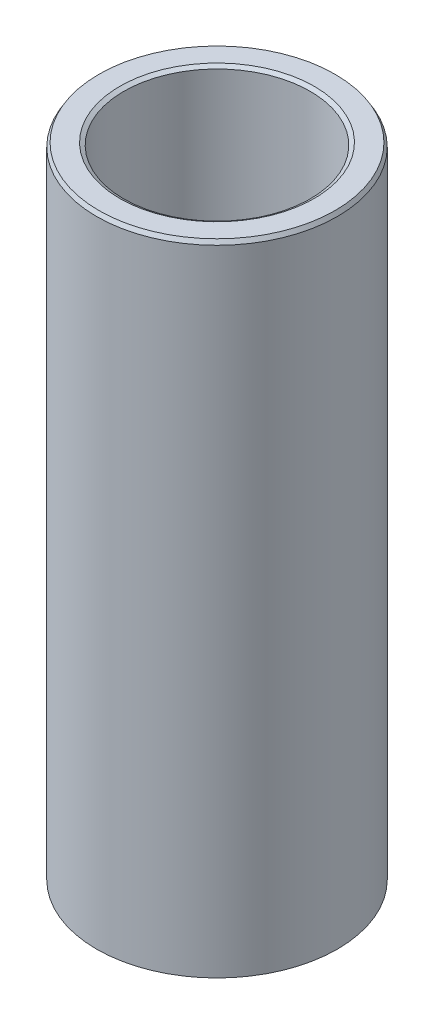
ISO-10303-21;
HEADER;
FILE_DESCRIPTION(('STEP AP214'),'2;1');
FILE_NAME('part.step','',(''),(''),'','','');
FILE_SCHEMA(('AUTOMOTIVE_DESIGN { 1 0 10303 214 1 1 1 1 }'));
ENDSEC;
DATA;
#1=APPLICATION_CONTEXT('core data for automotive mechanical design processes');
#2=APPLICATION_PROTOCOL_DEFINITION('international standard','automotive_design',2000,#1);
#3=PRODUCT_CONTEXT('',#1,'mechanical');
#4=PRODUCT('Part','Part','',(#3));
#5=PRODUCT_RELATED_PRODUCT_CATEGORY('part','',(#4));
#6=PRODUCT_DEFINITION_FORMATION('','',#4);
#7=PRODUCT_DEFINITION_CONTEXT('part definition',#1,'design');
#8=PRODUCT_DEFINITION('design','',#6,#7);
#9=PRODUCT_DEFINITION_SHAPE('','',#8);
#10=(LENGTH_UNIT() NAMED_UNIT(*) SI_UNIT(.MILLI.,.METRE.));
#11=(NAMED_UNIT(*) PLANE_ANGLE_UNIT() SI_UNIT($,.RADIAN.));
#12=(NAMED_UNIT(*) SI_UNIT($,.STERADIAN.) SOLID_ANGLE_UNIT());
#13=UNCERTAINTY_MEASURE_WITH_UNIT(LENGTH_MEASURE(1.E-05),#10,'distance_accuracy_value','');
#14=(GEOMETRIC_REPRESENTATION_CONTEXT(3) GLOBAL_UNCERTAINTY_ASSIGNED_CONTEXT((#13)) GLOBAL_UNIT_ASSIGNED_CONTEXT((#10,
#11,#12)) REPRESENTATION_CONTEXT('',''));
#15=CARTESIAN_POINT('',(0.,0.,0.));
#16=DIRECTION('',(0.,0.,1.));
#17=DIRECTION('',(1.,0.,0.));
#18=AXIS2_PLACEMENT_3D('',#15,#16,#17);
#19=CARTESIAN_POINT('',(0.,79.8459701971523,0.));
#20=DIRECTION('',(0.,-1.,0.));
#21=DIRECTION('',(0.,0.,-1.));
#22=AXIS2_PLACEMENT_3D('',#19,#20,#21);
#23=CYLINDRICAL_SURFACE('',#22,15.);
#24=CARTESIAN_POINT('',(0.,0.2902044874947,0.));
#25=DIRECTION('',(0.,1.,0.));
#26=DIRECTION('',(0.,0.,1.));
#27=AXIS2_PLACEMENT_3D('',#24,#25,#26);
#28=CIRCLE('',#27,15.);
#29=CARTESIAN_POINT('',(0.,0.2902044874947,15.));
#30=VERTEX_POINT('',#29);
#31=EDGE_CURVE('E10',#30,#30,#28,.T.);
#32=ORIENTED_EDGE('',*,*,#31,.T.);
#33=EDGE_LOOP('',(#32));
#34=FACE_BOUND('',#33,.T.);
#35=CARTESIAN_POINT('',(0.,79.3473891573823,0.));
#36=DIRECTION('',(0.,1.,0.));
#37=DIRECTION('',(0.,0.,1.));
#38=AXIS2_PLACEMENT_3D('',#35,#36,#37);
#39=CIRCLE('',#38,15.);
#40=CARTESIAN_POINT('',(0.,79.3473891573823,15.));
#41=VERTEX_POINT('',#40);
#42=EDGE_CURVE('E50',#41,#41,#39,.F.);
#43=ORIENTED_EDGE('',*,*,#42,.T.);
#44=EDGE_LOOP('',(#43));
#45=FACE_BOUND('',#44,.T.);
#46=ADVANCED_FACE('F39',(#34,#45),#23,.T.);
#47=CARTESIAN_POINT('',(0.,79.8459701971523,0.));
#48=DIRECTION('',(0.,1.,0.));
#49=DIRECTION('',(0.,0.,1.));
#50=AXIS2_PLACEMENT_3D('',#47,#48,#49);
#51=PLANE('',#50);
#52=CARTESIAN_POINT('',(0.,79.8459701971523,0.));
#53=DIRECTION('',(0.,1.,0.));
#54=DIRECTION('',(0.,0.,1.));
#55=AXIS2_PLACEMENT_3D('',#52,#53,#54);
#56=CIRCLE('',#55,12.113838860791);
#57=CARTESIAN_POINT('',(0.,79.8459701971523,12.113838860791));
#58=VERTEX_POINT('',#57);
#59=EDGE_CURVE('E58',#58,#58,#56,.F.);
#60=ORIENTED_EDGE('',*,*,#59,.T.);
#61=EDGE_LOOP('',(#60));
#62=FACE_BOUND('',#61,.T.);
#63=CARTESIAN_POINT('',(0.,79.8459701971523,0.));
#64=DIRECTION('',(0.,1.,0.));
#65=DIRECTION('',(0.,0.,1.));
#66=AXIS2_PLACEMENT_3D('',#63,#64,#65);
#67=CIRCLE('',#66,14.7097955125053);
#68=CARTESIAN_POINT('',(0.,79.8459701971523,14.7097955125053));
#69=VERTEX_POINT('',#68);
#70=EDGE_CURVE('E61',#69,#69,#67,.T.);
#71=ORIENTED_EDGE('',*,*,#70,.T.);
#72=EDGE_LOOP('',(#71));
#73=FACE_BOUND('',#72,.T.);
#74=ADVANCED_FACE('F88',(#62,#73),#51,.T.);
#75=CARTESIAN_POINT('',(0.,0.,0.));
#76=DIRECTION('',(0.,1.,0.));
#77=DIRECTION('',(0.,0.,1.));
#78=AXIS2_PLACEMENT_3D('',#75,#76,#77);
#79=PLANE('',#78);
#80=CARTESIAN_POINT('',(0.,0.,0.));
#81=DIRECTION('',(0.,1.,0.));
#82=DIRECTION('',(0.,0.,1.));
#83=AXIS2_PLACEMENT_3D('',#80,#81,#82);
#84=CIRCLE('',#83,11.9054623085157);
#85=CARTESIAN_POINT('',(0.,0.,11.9054623085157));
#86=VERTEX_POINT('',#85);
#87=EDGE_CURVE('E51',#86,#86,#84,.T.);
#88=ORIENTED_EDGE('',*,*,#87,.T.);
#89=EDGE_LOOP('',(#88));
#90=FACE_BOUND('',#89,.T.);
#91=CARTESIAN_POINT('',(0.,0.,0.));
#92=DIRECTION('',(0.,1.,0.));
#93=DIRECTION('',(0.,0.,1.));
#94=AXIS2_PLACEMENT_3D('',#91,#92,#93);
#95=CIRCLE('',#94,14.50141896023);
#96=CARTESIAN_POINT('',(0.,0.,14.50141896023));
#97=VERTEX_POINT('',#96);
#98=EDGE_CURVE('E54',#97,#97,#95,.F.);
#99=ORIENTED_EDGE('',*,*,#98,.T.);
#100=EDGE_LOOP('',(#99));
#101=FACE_BOUND('',#100,.T.);
#102=ADVANCED_FACE('F83',(#90,#101),#79,.F.);
#103=CARTESIAN_POINT('',(0.,79.8459701971523,0.));
#104=DIRECTION('',(0.,-1.,0.));
#105=DIRECTION('',(0.,0.,-1.));
#106=AXIS2_PLACEMENT_3D('',#103,#104,#105);
#107=CYLINDRICAL_SURFACE('',#106,11.615257821021);
#108=CARTESIAN_POINT('',(0.,79.5557657096576,0.));
#109=DIRECTION('',(0.,1.,0.));
#110=DIRECTION('',(0.,0.,1.));
#111=AXIS2_PLACEMENT_3D('',#108,#109,#110);
#112=CIRCLE('',#111,11.615257821021);
#113=CARTESIAN_POINT('',(0.,79.5557657096576,11.615257821021));
#114=VERTEX_POINT('',#113);
#115=EDGE_CURVE('E67',#114,#114,#112,.T.);
#116=ORIENTED_EDGE('',*,*,#115,.T.);
#117=EDGE_LOOP('',(#116));
#118=FACE_BOUND('',#117,.T.);
#119=CARTESIAN_POINT('',(0.,0.498581039770005,0.));
#120=DIRECTION('',(0.,1.,0.));
#121=DIRECTION('',(0.,0.,1.));
#122=AXIS2_PLACEMENT_3D('',#119,#120,#121);
#123=CIRCLE('',#122,11.615257821021);
#124=CARTESIAN_POINT('',(0.,0.498581039770005,11.615257821021));
#125=VERTEX_POINT('',#124);
#126=EDGE_CURVE('E69',#125,#125,#123,.F.);
#127=ORIENTED_EDGE('',*,*,#126,.T.);
#128=EDGE_LOOP('',(#127));
#129=FACE_BOUND('',#128,.T.);
#130=ADVANCED_FACE('F71',(#118,#129),#107,.F.);
#131=CARTESIAN_POINT('',(0.,79.5557657096576,0.));
#132=DIRECTION('',(0.,1.,0.));
#133=DIRECTION('',(0.,0.,1.));
#134=AXIS2_PLACEMENT_3D('',#131,#132,#133);
#135=CONICAL_SURFACE('',#134,11.615257821021,1.04367184623492);
#136=ORIENTED_EDGE('',*,*,#59,.F.);
#137=EDGE_LOOP('',(#136));
#138=FACE_BOUND('',#137,.T.);
#139=ORIENTED_EDGE('',*,*,#115,.F.);
#140=EDGE_LOOP('',(#139));
#141=FACE_BOUND('',#140,.T.);
#142=ADVANCED_FACE('F77',(#138,#141),#135,.F.);
#143=CARTESIAN_POINT('',(0.,0.,0.));
#144=DIRECTION('',(0.,-1.,0.));
#145=DIRECTION('',(0.,0.,-1.));
#146=AXIS2_PLACEMENT_3D('',#143,#144,#145);
#147=CONICAL_SURFACE('',#146,11.9054623085157,0.527124480559976);
#148=ORIENTED_EDGE('',*,*,#126,.F.);
#149=EDGE_LOOP('',(#148));
#150=FACE_BOUND('',#149,.T.);
#151=ORIENTED_EDGE('',*,*,#87,.F.);
#152=EDGE_LOOP('',(#151));
#153=FACE_BOUND('',#152,.T.);
#154=ADVANCED_FACE('F73',(#150,#153),#147,.F.);
#155=CARTESIAN_POINT('',(0.,0.2902044874947,0.));
#156=DIRECTION('',(0.,1.,0.));
#157=DIRECTION('',(0.,0.,1.));
#158=AXIS2_PLACEMENT_3D('',#155,#156,#157);
#159=CONICAL_SURFACE('',#158,15.,1.04367184623493);
#160=ORIENTED_EDGE('',*,*,#98,.F.);
#161=EDGE_LOOP('',(#160));
#162=FACE_BOUND('',#161,.T.);
#163=ORIENTED_EDGE('',*,*,#31,.F.);
#164=EDGE_LOOP('',(#163));
#165=FACE_BOUND('',#164,.T.);
#166=ADVANCED_FACE('F76',(#162,#165),#159,.T.);
#167=CARTESIAN_POINT('',(0.,79.8459701971523,0.));
#168=DIRECTION('',(0.,-1.,0.));
#169=DIRECTION('',(0.,0.,-1.));
#170=AXIS2_PLACEMENT_3D('',#167,#168,#169);
#171=CONICAL_SURFACE('',#170,14.7097955125053,0.527124480559977);
#172=ORIENTED_EDGE('',*,*,#42,.F.);
#173=EDGE_LOOP('',(#172));
#174=FACE_BOUND('',#173,.T.);
#175=ORIENTED_EDGE('',*,*,#70,.F.);
#176=EDGE_LOOP('',(#175));
#177=FACE_BOUND('',#176,.T.);
#178=ADVANCED_FACE('F45',(#174,#177),#171,.T.);
#179=CLOSED_SHELL('',(#46,#74,#102,#130,#142,#154,#166,#178));
#180=MANIFOLD_SOLID_BREP('B2',#179);
#181=ADVANCED_BREP_SHAPE_REPRESENTATION('',(#18,#180),#14);
#182=SHAPE_DEFINITION_REPRESENTATION(#9,#181);
ENDSEC;
END-ISO-10303-21;
